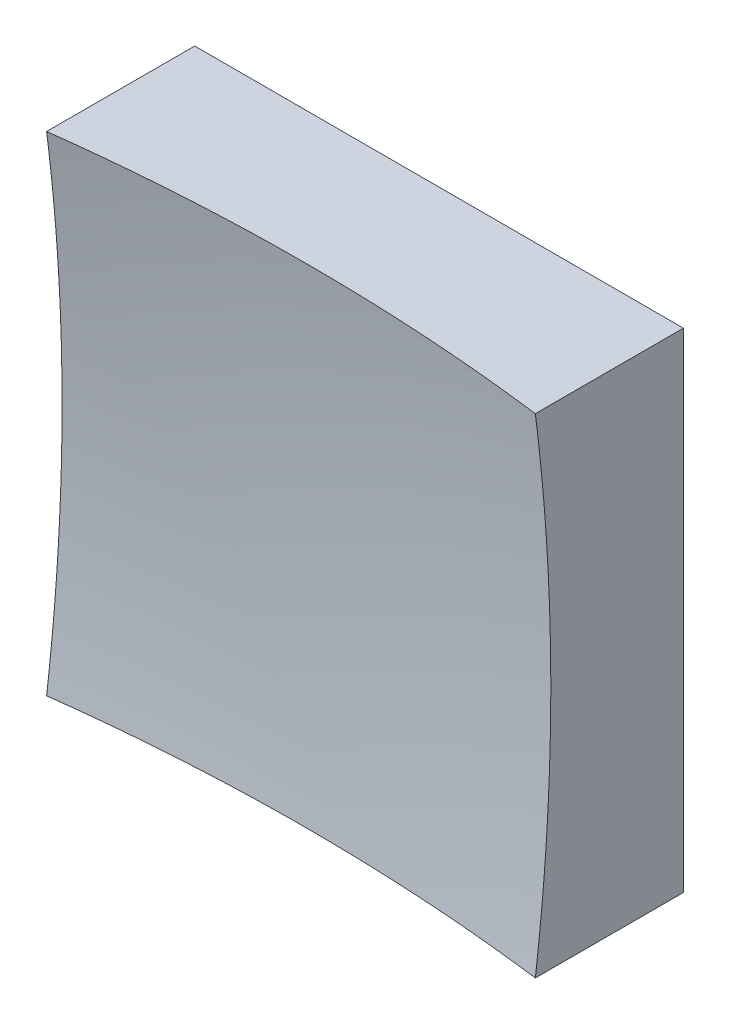
ISO-10303-21;
HEADER;
FILE_DESCRIPTION(('STEP AP214'),'2;1');
FILE_NAME('part.step','',(''),(''),'','','');
FILE_SCHEMA(('AUTOMOTIVE_DESIGN { 1 0 10303 214 1 1 1 1 }'));
ENDSEC;
DATA;
#1=APPLICATION_CONTEXT('core data for automotive mechanical design processes');
#2=APPLICATION_PROTOCOL_DEFINITION('international standard','automotive_design',2000,#1);
#3=PRODUCT_CONTEXT('',#1,'mechanical');
#4=PRODUCT('Part','Part','',(#3));
#5=PRODUCT_RELATED_PRODUCT_CATEGORY('part','',(#4));
#6=PRODUCT_DEFINITION_FORMATION('','',#4);
#7=PRODUCT_DEFINITION_CONTEXT('part definition',#1,'design');
#8=PRODUCT_DEFINITION('design','',#6,#7);
#9=PRODUCT_DEFINITION_SHAPE('','',#8);
#10=(LENGTH_UNIT() NAMED_UNIT(*) SI_UNIT(.MILLI.,.METRE.));
#11=(NAMED_UNIT(*) PLANE_ANGLE_UNIT() SI_UNIT($,.RADIAN.));
#12=(NAMED_UNIT(*) SI_UNIT($,.STERADIAN.) SOLID_ANGLE_UNIT());
#13=UNCERTAINTY_MEASURE_WITH_UNIT(LENGTH_MEASURE(1.E-05),#10,'distance_accuracy_value','');
#14=(GEOMETRIC_REPRESENTATION_CONTEXT(3) GLOBAL_UNCERTAINTY_ASSIGNED_CONTEXT((#13)) GLOBAL_UNIT_ASSIGNED_CONTEXT((#10,
#11,#12)) REPRESENTATION_CONTEXT('',''));
#15=CARTESIAN_POINT('',(0.,0.,0.));
#16=DIRECTION('',(0.,0.,1.));
#17=DIRECTION('',(1.,0.,0.));
#18=AXIS2_PLACEMENT_3D('',#15,#16,#17);
#19=CARTESIAN_POINT('',(-12.5,12.5,20.));
#20=DIRECTION('',(0.,1.,0.));
#21=DIRECTION('',(0.,0.,1.));
#22=AXIS2_PLACEMENT_3D('',#19,#20,#21);
#23=PLANE('',#22);
#24=CARTESIAN_POINT('',(0.,12.5,106.));
#25=DIRECTION('',(0.,1.,0.));
#26=DIRECTION('',(0.,0.,1.));
#27=AXIS2_PLACEMENT_3D('',#24,#25,#26);
#28=CIRCLE('',#27,99.2156741649222);
#29=CARTESIAN_POINT('',(12.5,12.5,7.57490157485235));
#30=VERTEX_POINT('',#29);
#31=CARTESIAN_POINT('',(-12.5,12.5,7.57490157485235));
#32=VERTEX_POINT('',#31);
#33=EDGE_CURVE('E79',#30,#32,#28,.T.);
#34=ORIENTED_EDGE('',*,*,#33,.F.);
#35=DIRECTION('',(0.,0.,-1.));
#36=VECTOR('',#35,1.);
#37=CARTESIAN_POINT('',(12.5,12.5,20.));
#38=LINE('',#37,#36);
#39=CARTESIAN_POINT('',(12.5,12.5,0.));
#40=VERTEX_POINT('',#39);
#41=EDGE_CURVE('E85',#30,#40,#38,.T.);
#42=ORIENTED_EDGE('',*,*,#41,.T.);
#43=DIRECTION('',(1.,0.,0.));
#44=VECTOR('',#43,1.);
#45=CARTESIAN_POINT('',(-12.5,12.5,0.));
#46=LINE('',#45,#44);
#47=CARTESIAN_POINT('',(-12.5,12.5,0.));
#48=VERTEX_POINT('',#47);
#49=EDGE_CURVE('E88',#48,#40,#46,.T.);
#50=ORIENTED_EDGE('',*,*,#49,.F.);
#51=DIRECTION('',(0.,0.,-1.));
#52=VECTOR('',#51,1.);
#53=CARTESIAN_POINT('',(-12.5,12.5,20.));
#54=LINE('',#53,#52);
#55=EDGE_CURVE('E47',#32,#48,#54,.T.);
#56=ORIENTED_EDGE('',*,*,#55,.F.);
#57=EDGE_LOOP('',(#34,#42,#50,#56));
#58=FACE_BOUND('',#57,.T.);
#59=ADVANCED_FACE('F39',(#58),#23,.T.);
#60=CARTESIAN_POINT('',(-12.5,12.5,20.));
#61=DIRECTION('',(1.,0.,0.));
#62=DIRECTION('',(0.,1.,0.));
#63=AXIS2_PLACEMENT_3D('',#60,#61,#62);
#64=PLANE('',#63);
#65=DIRECTION('',(0.,0.,-1.));
#66=VECTOR('',#65,1.);
#67=CARTESIAN_POINT('',(-12.5,-12.5,20.));
#68=LINE('',#67,#66);
#69=CARTESIAN_POINT('',(-12.5,-12.5,7.57490157485235));
#70=VERTEX_POINT('',#69);
#71=CARTESIAN_POINT('',(-12.5,-12.5,0.));
#72=VERTEX_POINT('',#71);
#73=EDGE_CURVE('E100',#70,#72,#68,.T.);
#74=ORIENTED_EDGE('',*,*,#73,.F.);
#75=CARTESIAN_POINT('',(-12.5,0.,106.));
#76=DIRECTION('',(1.,0.,0.));
#77=DIRECTION('',(0.,1.,0.));
#78=AXIS2_PLACEMENT_3D('',#75,#76,#77);
#79=CIRCLE('',#78,99.2156741649222);
#80=EDGE_CURVE('E89',#70,#32,#79,.T.);
#81=ORIENTED_EDGE('',*,*,#80,.T.);
#82=ORIENTED_EDGE('',*,*,#55,.T.);
#83=DIRECTION('',(0.,-1.,0.));
#84=VECTOR('',#83,1.);
#85=CARTESIAN_POINT('',(-12.5,12.5,0.));
#86=LINE('',#85,#84);
#87=EDGE_CURVE('E97',#48,#72,#86,.T.);
#88=ORIENTED_EDGE('',*,*,#87,.T.);
#89=EDGE_LOOP('',(#74,#81,#82,#88));
#90=FACE_BOUND('',#89,.T.);
#91=ADVANCED_FACE('F122',(#90),#64,.F.);
#92=CARTESIAN_POINT('',(-12.5,-12.5,20.));
#93=DIRECTION('',(0.,1.,0.));
#94=DIRECTION('',(0.,0.,1.));
#95=AXIS2_PLACEMENT_3D('',#92,#93,#94);
#96=PLANE('',#95);
#97=DIRECTION('',(0.,0.,-1.));
#98=VECTOR('',#97,1.);
#99=CARTESIAN_POINT('',(12.5,-12.5,20.));
#100=LINE('',#99,#98);
#101=CARTESIAN_POINT('',(12.5,-12.5,7.57490157485235));
#102=VERTEX_POINT('',#101);
#103=CARTESIAN_POINT('',(12.5,-12.5,0.));
#104=VERTEX_POINT('',#103);
#105=EDGE_CURVE('E96',#102,#104,#100,.T.);
#106=ORIENTED_EDGE('',*,*,#105,.F.);
#107=CARTESIAN_POINT('',(0.,-12.5,106.));
#108=DIRECTION('',(0.,1.,0.));
#109=DIRECTION('',(0.,0.,1.));
#110=AXIS2_PLACEMENT_3D('',#107,#108,#109);
#111=CIRCLE('',#110,99.2156741649222);
#112=EDGE_CURVE('E53',#102,#70,#111,.T.);
#113=ORIENTED_EDGE('',*,*,#112,.T.);
#114=ORIENTED_EDGE('',*,*,#73,.T.);
#115=DIRECTION('',(1.,0.,0.));
#116=VECTOR('',#115,1.);
#117=CARTESIAN_POINT('',(-12.5,-12.5,0.));
#118=LINE('',#117,#116);
#119=EDGE_CURVE('E102',#72,#104,#118,.T.);
#120=ORIENTED_EDGE('',*,*,#119,.T.);
#121=EDGE_LOOP('',(#106,#113,#114,#120));
#122=FACE_BOUND('',#121,.T.);
#123=ADVANCED_FACE('F121',(#122),#96,.F.);
#124=CARTESIAN_POINT('',(12.5,12.5,20.));
#125=DIRECTION('',(1.,0.,0.));
#126=DIRECTION('',(0.,1.,0.));
#127=AXIS2_PLACEMENT_3D('',#124,#125,#126);
#128=PLANE('',#127);
#129=CARTESIAN_POINT('',(12.5,0.,106.));
#130=DIRECTION('',(1.,0.,0.));
#131=DIRECTION('',(0.,1.,0.));
#132=AXIS2_PLACEMENT_3D('',#129,#130,#131);
#133=CIRCLE('',#132,99.2156741649222);
#134=EDGE_CURVE('E11',#102,#30,#133,.T.);
#135=ORIENTED_EDGE('',*,*,#134,.F.);
#136=ORIENTED_EDGE('',*,*,#105,.T.);
#137=DIRECTION('',(0.,-1.,0.));
#138=VECTOR('',#137,1.);
#139=CARTESIAN_POINT('',(12.5,12.5,0.));
#140=LINE('',#139,#138);
#141=EDGE_CURVE('E93',#40,#104,#140,.T.);
#142=ORIENTED_EDGE('',*,*,#141,.F.);
#143=ORIENTED_EDGE('',*,*,#41,.F.);
#144=EDGE_LOOP('',(#135,#136,#142,#143));
#145=FACE_BOUND('',#144,.T.);
#146=ADVANCED_FACE('F91',(#145),#128,.T.);
#147=CARTESIAN_POINT('',(0.,0.,0.));
#148=DIRECTION('',(0.,0.,-1.));
#149=DIRECTION('',(-1.,0.,0.));
#150=AXIS2_PLACEMENT_3D('',#147,#148,#149);
#151=PLANE('',#150);
#152=ORIENTED_EDGE('',*,*,#49,.T.);
#153=ORIENTED_EDGE('',*,*,#141,.T.);
#154=ORIENTED_EDGE('',*,*,#119,.F.);
#155=ORIENTED_EDGE('',*,*,#87,.F.);
#156=EDGE_LOOP('',(#152,#153,#154,#155));
#157=FACE_BOUND('',#156,.T.);
#158=ADVANCED_FACE('F125',(#157),#151,.T.);
#159=CARTESIAN_POINT('',(0.,0.,106.));
#160=DIRECTION('',(0.,0.,1.));
#161=DIRECTION('',(1.,0.,0.));
#162=AXIS2_PLACEMENT_3D('',#159,#160,#161);
#163=SPHERICAL_SURFACE('',#162,100.);
#164=ORIENTED_EDGE('',*,*,#33,.T.);
#165=ORIENTED_EDGE('',*,*,#80,.F.);
#166=ORIENTED_EDGE('',*,*,#112,.F.);
#167=ORIENTED_EDGE('',*,*,#134,.T.);
#168=EDGE_LOOP('',(#164,#165,#166,#167));
#169=FACE_BOUND('',#168,.T.);
#170=ADVANCED_FACE('F78',(#169),#163,.F.);
#171=CLOSED_SHELL('',(#59,#91,#123,#146,#158,#170));
#172=MANIFOLD_SOLID_BREP('B2',#171);
#173=ADVANCED_BREP_SHAPE_REPRESENTATION('',(#18,#172),#14);
#174=SHAPE_DEFINITION_REPRESENTATION(#9,#173);
ENDSEC;
END-ISO-10303-21;
